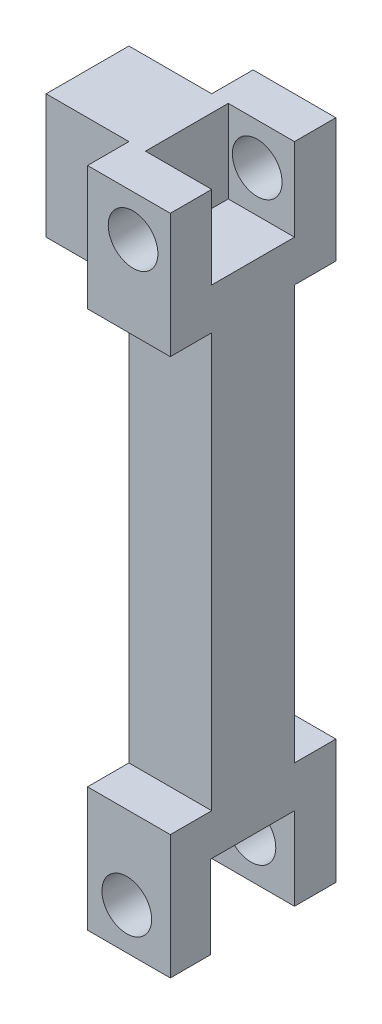
ISO-10303-21;
HEADER;
FILE_DESCRIPTION(('STEP AP214'),'2;1');
FILE_NAME('part.step','',(''),(''),'','','');
FILE_SCHEMA(('AUTOMOTIVE_DESIGN { 1 0 10303 214 1 1 1 1 }'));
ENDSEC;
DATA;
#1=APPLICATION_CONTEXT('core data for automotive mechanical design processes');
#2=APPLICATION_PROTOCOL_DEFINITION('international standard','automotive_design',2000,#1);
#3=PRODUCT_CONTEXT('',#1,'mechanical');
#4=PRODUCT('Part','Part','',(#3));
#5=PRODUCT_RELATED_PRODUCT_CATEGORY('part','',(#4));
#6=PRODUCT_DEFINITION_FORMATION('','',#4);
#7=PRODUCT_DEFINITION_CONTEXT('part definition',#1,'design');
#8=PRODUCT_DEFINITION('design','',#6,#7);
#9=PRODUCT_DEFINITION_SHAPE('','',#8);
#10=(LENGTH_UNIT() NAMED_UNIT(*) SI_UNIT(.MILLI.,.METRE.));
#11=(NAMED_UNIT(*) PLANE_ANGLE_UNIT() SI_UNIT($,.RADIAN.));
#12=(NAMED_UNIT(*) SI_UNIT($,.STERADIAN.) SOLID_ANGLE_UNIT());
#13=UNCERTAINTY_MEASURE_WITH_UNIT(LENGTH_MEASURE(1.E-05),#10,'distance_accuracy_value','');
#14=(GEOMETRIC_REPRESENTATION_CONTEXT(3) GLOBAL_UNCERTAINTY_ASSIGNED_CONTEXT((#13)) GLOBAL_UNIT_ASSIGNED_CONTEXT((#10,
#11,#12)) REPRESENTATION_CONTEXT('',''));
#15=CARTESIAN_POINT('',(0.,0.,0.));
#16=DIRECTION('',(0.,0.,1.));
#17=DIRECTION('',(1.,0.,0.));
#18=AXIS2_PLACEMENT_3D('',#15,#16,#17);
#19=CARTESIAN_POINT('',(-29.9761133603239,67.4933873144399,-25.4));
#20=DIRECTION('',(0.,0.,1.));
#21=DIRECTION('',(1.,0.,0.));
#22=AXIS2_PLACEMENT_3D('',#19,#20,#21);
#23=PLANE('',#22);
#24=DIRECTION('',(0.,-1.,0.));
#25=VECTOR('',#24,1.);
#26=CARTESIAN_POINT('',(-29.9761133603239,29.3933873144399,-25.4));
#27=LINE('',#26,#25);
#28=CARTESIAN_POINT('',(-29.9761133603239,29.39338731444,-25.4));
#29=VERTEX_POINT('',#28);
#30=CARTESIAN_POINT('',(-29.9761133603239,-97.6066126855601,-25.4));
#31=VERTEX_POINT('',#30);
#32=EDGE_CURVE('E363',#29,#31,#27,.T.);
#33=ORIENTED_EDGE('',*,*,#32,.F.);
#34=DIRECTION('',(1.,0.,0.));
#35=VECTOR('',#34,1.);
#36=CARTESIAN_POINT('',(-29.9761133603239,29.39338731444,-25.4));
#37=LINE('',#36,#35);
#38=CARTESIAN_POINT('',(-4.5761133603239,29.39338731444,-25.4));
#39=VERTEX_POINT('',#38);
#40=EDGE_CURVE('E246',#29,#39,#37,.T.);
#41=ORIENTED_EDGE('',*,*,#40,.T.);
#42=DIRECTION('',(0.,1.,0.));
#43=VECTOR('',#42,1.);
#44=CARTESIAN_POINT('',(-4.5761133603239,67.4933873144399,-25.4));
#45=LINE('',#44,#43);
#46=CARTESIAN_POINT('',(-4.57611336032388,-97.6066126855601,-25.4));
#47=VERTEX_POINT('',#46);
#48=EDGE_CURVE('E360',#47,#39,#45,.T.);
#49=ORIENTED_EDGE('',*,*,#48,.F.);
#50=DIRECTION('',(-1.,0.,0.));
#51=VECTOR('',#50,1.);
#52=CARTESIAN_POINT('',(-4.57611336032388,-97.6066126855601,-25.4));
#53=LINE('',#52,#51);
#54=EDGE_CURVE('E394',#47,#31,#53,.T.);
#55=ORIENTED_EDGE('',*,*,#54,.T.);
#56=EDGE_LOOP('',(#33,#41,#49,#55));
#57=FACE_BOUND('',#56,.T.);
#58=ADVANCED_FACE('F35',(#57),#23,.F.);
#59=CARTESIAN_POINT('',(-29.9761133603239,67.4933873144399,0.));
#60=DIRECTION('',(0.,0.,1.));
#61=DIRECTION('',(1.,0.,0.));
#62=AXIS2_PLACEMENT_3D('',#59,#60,#61);
#63=PLANE('',#62);
#64=DIRECTION('',(1.,0.,0.));
#65=VECTOR('',#64,1.);
#66=CARTESIAN_POINT('',(-29.9761133603239,29.3933873144399,0.));
#67=LINE('',#66,#65);
#68=CARTESIAN_POINT('',(-55.3761133603239,29.3933873144399,0.));
#69=VERTEX_POINT('',#68);
#70=CARTESIAN_POINT('',(-29.9761133603239,29.3933873144399,0.));
#71=VERTEX_POINT('',#70);
#72=EDGE_CURVE('E383',#69,#71,#67,.T.);
#73=ORIENTED_EDGE('',*,*,#72,.T.);
#74=DIRECTION('',(0.,1.,0.));
#75=VECTOR('',#74,1.);
#76=CARTESIAN_POINT('',(-29.9761133603239,67.49338731444,0.));
#77=LINE('',#76,#75);
#78=CARTESIAN_POINT('',(-29.9761133603239,67.4933873144399,0.));
#79=VERTEX_POINT('',#78);
#80=EDGE_CURVE('E58',#71,#79,#77,.T.);
#81=ORIENTED_EDGE('',*,*,#80,.T.);
#82=DIRECTION('',(-1.,0.,0.));
#83=VECTOR('',#82,1.);
#84=CARTESIAN_POINT('',(-29.9761133603239,67.4933873144399,0.));
#85=LINE('',#84,#83);
#86=CARTESIAN_POINT('',(-55.3761133603239,67.4933873144399,0.));
#87=VERTEX_POINT('',#86);
#88=EDGE_CURVE('E378',#79,#87,#85,.T.);
#89=ORIENTED_EDGE('',*,*,#88,.T.);
#90=DIRECTION('',(0.,-1.,0.));
#91=VECTOR('',#90,1.);
#92=CARTESIAN_POINT('',(-55.3761133603239,67.4933873144399,0.));
#93=LINE('',#92,#91);
#94=EDGE_CURVE('E403',#87,#69,#93,.T.);
#95=ORIENTED_EDGE('',*,*,#94,.T.);
#96=EDGE_LOOP('',(#73,#81,#89,#95));
#97=FACE_BOUND('',#96,.T.);
#98=ADVANCED_FACE('F492',(#97),#63,.T.);
#99=CARTESIAN_POINT('',(-4.57611336032388,-135.70661268556,-25.4));
#100=DIRECTION('',(0.,-1.,0.));
#101=DIRECTION('',(0.,0.,-1.));
#102=AXIS2_PLACEMENT_3D('',#99,#100,#101);
#103=PLANE('',#102);
#104=DIRECTION('',(-1.,0.,0.));
#105=VECTOR('',#104,1.);
#106=CARTESIAN_POINT('',(-4.57611336032387,-135.70661268556,0.351736714748092));
#107=LINE('',#106,#105);
#108=CARTESIAN_POINT('',(-4.57611336032387,-135.70661268556,0.351736714748092));
#109=VERTEX_POINT('',#108);
#110=CARTESIAN_POINT('',(-29.9761133603239,-135.70661268556,0.351736714748092));
#111=VERTEX_POINT('',#110);
#112=EDGE_CURVE('E297',#109,#111,#107,.T.);
#113=ORIENTED_EDGE('',*,*,#112,.F.);
#114=DIRECTION('',(0.,0.,1.));
#115=VECTOR('',#114,1.);
#116=CARTESIAN_POINT('',(-4.57611336032388,-135.70661268556,-25.4));
#117=LINE('',#116,#115);
#118=CARTESIAN_POINT('',(-4.57611336032387,-135.70661268556,12.7));
#119=VERTEX_POINT('',#118);
#120=EDGE_CURVE('E347',#109,#119,#117,.T.);
#121=ORIENTED_EDGE('',*,*,#120,.T.);
#122=DIRECTION('',(-1.,0.,0.));
#123=VECTOR('',#122,1.);
#124=CARTESIAN_POINT('',(-4.57611336032387,-135.70661268556,12.7));
#125=LINE('',#124,#123);
#126=CARTESIAN_POINT('',(-29.9761133603239,-135.70661268556,12.7));
#127=VERTEX_POINT('',#126);
#128=EDGE_CURVE('E315',#119,#127,#125,.T.);
#129=ORIENTED_EDGE('',*,*,#128,.T.);
#130=DIRECTION('',(0.,0.,1.));
#131=VECTOR('',#130,1.);
#132=CARTESIAN_POINT('',(-29.9761133603239,-135.70661268556,-25.4));
#133=LINE('',#132,#131);
#134=EDGE_CURVE('E351',#111,#127,#133,.T.);
#135=ORIENTED_EDGE('',*,*,#134,.F.);
#136=EDGE_LOOP('',(#113,#121,#129,#135));
#137=FACE_BOUND('',#136,.T.);
#138=ADVANCED_FACE('F438',(#137),#103,.T.);
#139=CARTESIAN_POINT('',(-29.9761133603239,67.4933873144399,-25.4));
#140=DIRECTION('',(0.,1.,0.));
#141=DIRECTION('',(0.,0.,1.));
#142=AXIS2_PLACEMENT_3D('',#139,#140,#141);
#143=PLANE('',#142);
#144=DIRECTION('',(1.,0.,0.));
#145=VECTOR('',#144,1.);
#146=CARTESIAN_POINT('',(-24.8961133603239,67.49338731444,0.));
#147=LINE('',#146,#145);
#148=CARTESIAN_POINT('',(-24.8961133603239,67.49338731444,0.));
#149=VERTEX_POINT('',#148);
#150=CARTESIAN_POINT('',(-4.5761133603239,67.49338731444,0.));
#151=VERTEX_POINT('',#150);
#152=EDGE_CURVE('E225',#149,#151,#147,.T.);
#153=ORIENTED_EDGE('',*,*,#152,.F.);
#154=DIRECTION('',(0.,0.,1.));
#155=VECTOR('',#154,1.);
#156=CARTESIAN_POINT('',(-24.8961133603239,67.49338731444,0.));
#157=LINE('',#156,#155);
#158=CARTESIAN_POINT('',(-24.8961133603239,67.49338731444,-25.4));
#159=VERTEX_POINT('',#158);
#160=EDGE_CURVE('E222',#159,#149,#157,.T.);
#161=ORIENTED_EDGE('',*,*,#160,.F.);
#162=DIRECTION('',(1.,0.,0.));
#163=VECTOR('',#162,1.);
#164=CARTESIAN_POINT('',(-24.8961133603239,67.49338731444,-25.4));
#165=LINE('',#164,#163);
#166=CARTESIAN_POINT('',(-4.5761133603239,67.49338731444,-25.4));
#167=VERTEX_POINT('',#166);
#168=EDGE_CURVE('E201',#159,#167,#165,.T.);
#169=ORIENTED_EDGE('',*,*,#168,.T.);
#170=DIRECTION('',(0.,0.,1.));
#171=VECTOR('',#170,1.);
#172=CARTESIAN_POINT('',(-4.5761133603239,67.4933873144399,-25.4));
#173=LINE('',#172,#171);
#174=CARTESIAN_POINT('',(-4.5761133603239,67.4933873144399,-38.1));
#175=VERTEX_POINT('',#174);
#176=EDGE_CURVE('E212',#175,#167,#173,.T.);
#177=ORIENTED_EDGE('',*,*,#176,.F.);
#178=DIRECTION('',(1.,0.,0.));
#179=VECTOR('',#178,1.);
#180=CARTESIAN_POINT('',(-29.9761133603239,67.4933873144399,-38.1));
#181=LINE('',#180,#179);
#182=CARTESIAN_POINT('',(-29.9761133603239,67.4933873144399,-38.1));
#183=VERTEX_POINT('',#182);
#184=EDGE_CURVE('E250',#183,#175,#181,.T.);
#185=ORIENTED_EDGE('',*,*,#184,.F.);
#186=DIRECTION('',(0.,0.,1.));
#187=VECTOR('',#186,1.);
#188=CARTESIAN_POINT('',(-29.9761133603239,67.4933873144399,-25.4));
#189=LINE('',#188,#187);
#190=CARTESIAN_POINT('',(-29.9761133603239,67.4933873144399,-25.4));
#191=VERTEX_POINT('',#190);
#192=EDGE_CURVE('E240',#183,#191,#189,.T.);
#193=ORIENTED_EDGE('',*,*,#192,.T.);
#194=DIRECTION('',(-1.,0.,0.));
#195=VECTOR('',#194,1.);
#196=CARTESIAN_POINT('',(-29.9761133603239,67.4933873144399,-25.4));
#197=LINE('',#196,#195);
#198=CARTESIAN_POINT('',(-55.3761133603239,67.4933873144399,-25.4));
#199=VERTEX_POINT('',#198);
#200=EDGE_CURVE('E376',#191,#199,#197,.T.);
#201=ORIENTED_EDGE('',*,*,#200,.T.);
#202=DIRECTION('',(0.,0.,1.));
#203=VECTOR('',#202,1.);
#204=CARTESIAN_POINT('',(-55.3761133603239,67.4933873144399,-25.4));
#205=LINE('',#204,#203);
#206=EDGE_CURVE('E357',#199,#87,#205,.T.);
#207=ORIENTED_EDGE('',*,*,#206,.T.);
#208=ORIENTED_EDGE('',*,*,#88,.F.);
#209=DIRECTION('',(0.,0.,1.));
#210=VECTOR('',#209,1.);
#211=CARTESIAN_POINT('',(-29.9761133603239,67.4933873144399,12.7));
#212=LINE('',#211,#210);
#213=CARTESIAN_POINT('',(-29.9761133603239,67.4933873144399,12.7));
#214=VERTEX_POINT('',#213);
#215=EDGE_CURVE('E266',#79,#214,#212,.T.);
#216=ORIENTED_EDGE('',*,*,#215,.T.);
#217=DIRECTION('',(1.,0.,0.));
#218=VECTOR('',#217,1.);
#219=CARTESIAN_POINT('',(-29.9761133603239,67.4933873144399,12.7));
#220=LINE('',#219,#218);
#221=CARTESIAN_POINT('',(-4.5761133603239,67.4933873144399,12.7));
#222=VERTEX_POINT('',#221);
#223=EDGE_CURVE('E270',#214,#222,#220,.T.);
#224=ORIENTED_EDGE('',*,*,#223,.T.);
#225=EDGE_CURVE('E338',#151,#222,#173,.T.);
#226=ORIENTED_EDGE('',*,*,#225,.F.);
#227=EDGE_LOOP('',(#153,#161,#169,#177,#185,#193,#201,#207,#208,#216,#224,#226));
#228=FACE_BOUND('',#227,.T.);
#229=ADVANCED_FACE('F473',(#228),#143,.T.);
#230=CARTESIAN_POINT('',(-4.5761133603239,67.4933873144399,-25.4));
#231=DIRECTION('',(1.,0.,0.));
#232=DIRECTION('',(0.,1.,0.));
#233=AXIS2_PLACEMENT_3D('',#230,#231,#232);
#234=PLANE('',#233);
#235=DIRECTION('',(0.,-1.,0.));
#236=VECTOR('',#235,1.);
#237=CARTESIAN_POINT('',(-4.5761133603239,67.49338731444,0.));
#238=LINE('',#237,#236);
#239=CARTESIAN_POINT('',(-4.5761133603239,42.09338731444,0.));
#240=VERTEX_POINT('',#239);
#241=EDGE_CURVE('E50',#151,#240,#238,.T.);
#242=ORIENTED_EDGE('',*,*,#241,.F.);
#243=ORIENTED_EDGE('',*,*,#225,.T.);
#244=DIRECTION('',(0.,-1.,0.));
#245=VECTOR('',#244,1.);
#246=CARTESIAN_POINT('',(-4.5761133603239,67.4933873144399,12.7));
#247=LINE('',#246,#245);
#248=CARTESIAN_POINT('',(-4.5761133603239,29.3933873144399,12.7));
#249=VERTEX_POINT('',#248);
#250=EDGE_CURVE('E249',#222,#249,#247,.T.);
#251=ORIENTED_EDGE('',*,*,#250,.T.);
#252=DIRECTION('',(0.,0.,-1.));
#253=VECTOR('',#252,1.);
#254=CARTESIAN_POINT('',(-4.5761133603239,29.3933873144399,12.7));
#255=LINE('',#254,#253);
#256=CARTESIAN_POINT('',(-4.5761133603239,29.3933873144399,0.));
#257=VERTEX_POINT('',#256);
#258=EDGE_CURVE('E256',#249,#257,#255,.T.);
#259=ORIENTED_EDGE('',*,*,#258,.T.);
#260=DIRECTION('',(0.,1.,0.));
#261=VECTOR('',#260,1.);
#262=CARTESIAN_POINT('',(-4.5761133603239,67.4933873144399,0.));
#263=LINE('',#262,#261);
#264=CARTESIAN_POINT('',(-4.57611336032388,-97.6066126855601,0.));
#265=VERTEX_POINT('',#264);
#266=EDGE_CURVE('E325',#265,#257,#263,.T.);
#267=ORIENTED_EDGE('',*,*,#266,.F.);
#268=DIRECTION('',(0.,0.,-1.));
#269=VECTOR('',#268,1.);
#270=CARTESIAN_POINT('',(-4.57611336032388,-97.6066126855601,0.));
#271=LINE('',#270,#269);
#272=CARTESIAN_POINT('',(-4.57611336032388,-97.6066126855601,12.7));
#273=VERTEX_POINT('',#272);
#274=EDGE_CURVE('E307',#273,#265,#271,.T.);
#275=ORIENTED_EDGE('',*,*,#274,.F.);
#276=DIRECTION('',(0.,1.,0.));
#277=VECTOR('',#276,1.);
#278=CARTESIAN_POINT('',(-4.57611336032387,-135.70661268556,12.7));
#279=LINE('',#278,#277);
#280=EDGE_CURVE('E308',#119,#273,#279,.T.);
#281=ORIENTED_EDGE('',*,*,#280,.F.);
#282=ORIENTED_EDGE('',*,*,#120,.F.);
#283=DIRECTION('',(0.,1.,0.));
#284=VECTOR('',#283,1.);
#285=CARTESIAN_POINT('',(-4.57611336032387,-135.70661268556,0.351736714748092));
#286=LINE('',#285,#284);
#287=CARTESIAN_POINT('',(-4.57611336032388,-110.30661268556,0.351736714748092));
#288=VERTEX_POINT('',#287);
#289=EDGE_CURVE('E290',#109,#288,#286,.T.);
#290=ORIENTED_EDGE('',*,*,#289,.T.);
#291=DIRECTION('',(0.,0.,-1.));
#292=VECTOR('',#291,1.);
#293=CARTESIAN_POINT('',(-4.57611336032388,-110.30661268556,0.351736714748092));
#294=LINE('',#293,#292);
#295=CARTESIAN_POINT('',(-4.57611336032388,-110.30661268556,-25.4));
#296=VERTEX_POINT('',#295);
#297=EDGE_CURVE('E284',#288,#296,#294,.T.);
#298=ORIENTED_EDGE('',*,*,#297,.T.);
#299=DIRECTION('',(0.,-1.,0.));
#300=VECTOR('',#299,1.);
#301=CARTESIAN_POINT('',(-4.57611336032388,-110.30661268556,-25.4));
#302=LINE('',#301,#300);
#303=CARTESIAN_POINT('',(-4.57611336032387,-135.70661268556,-25.4));
#304=VERTEX_POINT('',#303);
#305=EDGE_CURVE('E287',#296,#304,#302,.T.);
#306=ORIENTED_EDGE('',*,*,#305,.T.);
#307=CARTESIAN_POINT('',(-4.57611336032387,-135.70661268556,-38.1));
#308=VERTEX_POINT('',#307);
#309=EDGE_CURVE('E340',#308,#304,#117,.T.);
#310=ORIENTED_EDGE('',*,*,#309,.F.);
#311=DIRECTION('',(0.,-1.,0.));
#312=VECTOR('',#311,1.);
#313=CARTESIAN_POINT('',(-4.57611336032387,-135.70661268556,-38.1));
#314=LINE('',#313,#312);
#315=CARTESIAN_POINT('',(-4.57611336032388,-97.6066126855601,-38.1));
#316=VERTEX_POINT('',#315);
#317=EDGE_CURVE('E393',#316,#308,#314,.T.);
#318=ORIENTED_EDGE('',*,*,#317,.F.);
#319=DIRECTION('',(0.,0.,-1.));
#320=VECTOR('',#319,1.);
#321=CARTESIAN_POINT('',(-4.57611336032388,-97.6066126855601,-38.1));
#322=LINE('',#321,#320);
#323=EDGE_CURVE('E389',#47,#316,#322,.T.);
#324=ORIENTED_EDGE('',*,*,#323,.F.);
#325=ORIENTED_EDGE('',*,*,#48,.T.);
#326=DIRECTION('',(0.,0.,-1.));
#327=VECTOR('',#326,1.);
#328=CARTESIAN_POINT('',(-4.5761133603239,29.39338731444,-25.4));
#329=LINE('',#328,#327);
#330=CARTESIAN_POINT('',(-4.5761133603239,29.3933873144399,-38.1));
#331=VERTEX_POINT('',#330);
#332=EDGE_CURVE('E227',#39,#331,#329,.T.);
#333=ORIENTED_EDGE('',*,*,#332,.T.);
#334=DIRECTION('',(0.,1.,0.));
#335=VECTOR('',#334,1.);
#336=CARTESIAN_POINT('',(-4.5761133603239,67.4933873144399,-38.1));
#337=LINE('',#336,#335);
#338=EDGE_CURVE('E232',#331,#175,#337,.T.);
#339=ORIENTED_EDGE('',*,*,#338,.T.);
#340=ORIENTED_EDGE('',*,*,#176,.T.);
#341=DIRECTION('',(0.,1.,0.));
#342=VECTOR('',#341,1.);
#343=CARTESIAN_POINT('',(-4.5761133603239,67.49338731444,-25.4));
#344=LINE('',#343,#342);
#345=CARTESIAN_POINT('',(-4.5761133603239,42.09338731444,-25.4));
#346=VERTEX_POINT('',#345);
#347=EDGE_CURVE('E194',#346,#167,#344,.T.);
#348=ORIENTED_EDGE('',*,*,#347,.F.);
#349=DIRECTION('',(0.,0.,-1.));
#350=VECTOR('',#349,1.);
#351=CARTESIAN_POINT('',(-4.5761133603239,42.09338731444,0.));
#352=LINE('',#351,#350);
#353=EDGE_CURVE('E205',#240,#346,#352,.T.);
#354=ORIENTED_EDGE('',*,*,#353,.F.);
#355=EDGE_LOOP('',(#242,#243,#251,#259,#267,#275,#281,#282,#290,#298,#306,#310,#318,#324,#325,
#333,#339,#340,#348,#354));
#356=FACE_BOUND('',#355,.T.);
#357=ADVANCED_FACE('F210',(#356),#234,.T.);
#358=DIRECTION('',(-1.,0.,0.));
#359=VECTOR('',#358,1.);
#360=CARTESIAN_POINT('',(-4.57611336032387,-135.70661268556,-25.4));
#361=LINE('',#360,#359);
#362=CARTESIAN_POINT('',(-29.9761133603239,-135.70661268556,-25.4));
#363=VERTEX_POINT('',#362);
#364=EDGE_CURVE('E299',#304,#363,#361,.T.);
#365=ORIENTED_EDGE('',*,*,#364,.T.);
#366=CARTESIAN_POINT('',(-29.9761133603239,-135.70661268556,-38.1));
#367=VERTEX_POINT('',#366);
#368=EDGE_CURVE('E348',#367,#363,#133,.T.);
#369=ORIENTED_EDGE('',*,*,#368,.F.);
#370=DIRECTION('',(-1.,0.,0.));
#371=VECTOR('',#370,1.);
#372=CARTESIAN_POINT('',(-4.57611336032387,-135.70661268556,-38.1));
#373=LINE('',#372,#371);
#374=EDGE_CURVE('E392',#308,#367,#373,.T.);
#375=ORIENTED_EDGE('',*,*,#374,.F.);
#376=ORIENTED_EDGE('',*,*,#309,.T.);
#377=EDGE_LOOP('',(#365,#369,#375,#376));
#378=FACE_BOUND('',#377,.T.);
#379=ADVANCED_FACE('F425',(#378),#103,.T.);
#380=CARTESIAN_POINT('',(-29.9761133603239,29.3933873144399,-25.4));
#381=DIRECTION('',(-1.,0.,0.));
#382=DIRECTION('',(0.,-1.,0.));
#383=AXIS2_PLACEMENT_3D('',#380,#381,#382);
#384=PLANE('',#383);
#385=DIRECTION('',(0.,1.,0.));
#386=VECTOR('',#385,1.);
#387=CARTESIAN_POINT('',(-29.9761133603239,-135.70661268556,0.351736714748092));
#388=LINE('',#387,#386);
#389=CARTESIAN_POINT('',(-29.9761133603239,-110.30661268556,0.351736714748092));
#390=VERTEX_POINT('',#389);
#391=EDGE_CURVE('E281',#111,#390,#388,.T.);
#392=ORIENTED_EDGE('',*,*,#391,.F.);
#393=ORIENTED_EDGE('',*,*,#134,.T.);
#394=DIRECTION('',(0.,1.,0.));
#395=VECTOR('',#394,1.);
#396=CARTESIAN_POINT('',(-29.9761133603239,-135.70661268556,12.7));
#397=LINE('',#396,#395);
#398=CARTESIAN_POINT('',(-29.9761133603239,-97.6066126855601,12.7));
#399=VERTEX_POINT('',#398);
#400=EDGE_CURVE('E304',#127,#399,#397,.T.);
#401=ORIENTED_EDGE('',*,*,#400,.T.);
#402=DIRECTION('',(0.,0.,-1.));
#403=VECTOR('',#402,1.);
#404=CARTESIAN_POINT('',(-29.9761133603239,-97.6066126855601,0.));
#405=LINE('',#404,#403);
#406=CARTESIAN_POINT('',(-29.9761133603239,-97.6066126855601,0.));
#407=VERTEX_POINT('',#406);
#408=EDGE_CURVE('E296',#399,#407,#405,.T.);
#409=ORIENTED_EDGE('',*,*,#408,.T.);
#410=DIRECTION('',(0.,-1.,0.));
#411=VECTOR('',#410,1.);
#412=CARTESIAN_POINT('',(-29.9761133603239,29.3933873144399,0.));
#413=LINE('',#412,#411);
#414=EDGE_CURVE('E385',#71,#407,#413,.T.);
#415=ORIENTED_EDGE('',*,*,#414,.F.);
#416=DIRECTION('',(0.,0.,1.));
#417=VECTOR('',#416,1.);
#418=CARTESIAN_POINT('',(-29.9761133603239,29.3933873144399,-25.4));
#419=LINE('',#418,#417);
#420=EDGE_CURVE('E352',#29,#71,#419,.T.);
#421=ORIENTED_EDGE('',*,*,#420,.F.);
#422=ORIENTED_EDGE('',*,*,#32,.T.);
#423=DIRECTION('',(0.,0.,-1.));
#424=VECTOR('',#423,1.);
#425=CARTESIAN_POINT('',(-29.9761133603239,-97.6066126855601,-38.1));
#426=LINE('',#425,#424);
#427=CARTESIAN_POINT('',(-29.9761133603239,-97.6066126855601,-38.1));
#428=VERTEX_POINT('',#427);
#429=EDGE_CURVE('E367',#31,#428,#426,.T.);
#430=ORIENTED_EDGE('',*,*,#429,.T.);
#431=DIRECTION('',(0.,-1.,0.));
#432=VECTOR('',#431,1.);
#433=CARTESIAN_POINT('',(-29.9761133603239,-135.70661268556,-38.1));
#434=LINE('',#433,#432);
#435=EDGE_CURVE('E314',#428,#367,#434,.T.);
#436=ORIENTED_EDGE('',*,*,#435,.T.);
#437=ORIENTED_EDGE('',*,*,#368,.T.);
#438=DIRECTION('',(0.,-1.,0.));
#439=VECTOR('',#438,1.);
#440=CARTESIAN_POINT('',(-29.9761133603239,-110.30661268556,-25.4));
#441=LINE('',#440,#439);
#442=CARTESIAN_POINT('',(-29.9761133603239,-110.30661268556,-25.4));
#443=VERTEX_POINT('',#442);
#444=EDGE_CURVE('E279',#443,#363,#441,.T.);
#445=ORIENTED_EDGE('',*,*,#444,.F.);
#446=DIRECTION('',(0.,0.,-1.));
#447=VECTOR('',#446,1.);
#448=CARTESIAN_POINT('',(-29.9761133603239,-110.30661268556,0.351736714748092));
#449=LINE('',#448,#447);
#450=EDGE_CURVE('E273',#390,#443,#449,.T.);
#451=ORIENTED_EDGE('',*,*,#450,.F.);
#452=EDGE_LOOP('',(#392,#393,#401,#409,#415,#421,#422,#430,#436,#437,#445,#451));
#453=FACE_BOUND('',#452,.T.);
#454=ADVANCED_FACE('F419',(#453),#384,.T.);
#455=CARTESIAN_POINT('',(-29.9761133603239,29.3933873144399,-25.4));
#456=DIRECTION('',(0.,-1.,0.));
#457=DIRECTION('',(1.,0.,0.));
#458=AXIS2_PLACEMENT_3D('',#455,#456,#457);
#459=PLANE('',#458);
#460=ORIENTED_EDGE('',*,*,#72,.F.);
#461=DIRECTION('',(0.,0.,1.));
#462=VECTOR('',#461,1.);
#463=CARTESIAN_POINT('',(-55.3761133603239,29.3933873144399,-25.4));
#464=LINE('',#463,#462);
#465=CARTESIAN_POINT('',(-55.3761133603239,29.3933873144399,-25.4));
#466=VERTEX_POINT('',#465);
#467=EDGE_CURVE('E355',#466,#69,#464,.T.);
#468=ORIENTED_EDGE('',*,*,#467,.F.);
#469=DIRECTION('',(1.,0.,0.));
#470=VECTOR('',#469,1.);
#471=CARTESIAN_POINT('',(-29.9761133603239,29.3933873144399,-25.4));
#472=LINE('',#471,#470);
#473=EDGE_CURVE('E366',#466,#29,#472,.T.);
#474=ORIENTED_EDGE('',*,*,#473,.T.);
#475=ORIENTED_EDGE('',*,*,#420,.T.);
#476=EDGE_LOOP('',(#460,#468,#474,#475));
#477=FACE_BOUND('',#476,.T.);
#478=ADVANCED_FACE('F460',(#477),#459,.T.);
#479=CARTESIAN_POINT('',(-55.3761133603239,67.4933873144399,-25.4));
#480=DIRECTION('',(-1.,0.,0.));
#481=DIRECTION('',(0.,-1.,0.));
#482=AXIS2_PLACEMENT_3D('',#479,#480,#481);
#483=PLANE('',#482);
#484=CARTESIAN_POINT('',(-55.3761133603239,49.4297522150103,-13.0885412320957));
#485=DIRECTION('',(-1.,0.,0.));
#486=DIRECTION('',(0.,-1.,0.));
#487=AXIS2_PLACEMENT_3D('',#484,#485,#486);
#488=CIRCLE('',#487,7.62);
#489=CARTESIAN_POINT('',(-55.3761133603239,41.8097522150103,-13.0885412320957));
#490=VERTEX_POINT('',#489);
#491=EDGE_CURVE('E687',#490,#490,#488,.T.);
#492=ORIENTED_EDGE('',*,*,#491,.F.);
#493=EDGE_LOOP('',(#492));
#494=FACE_BOUND('',#493,.T.);
#495=ORIENTED_EDGE('',*,*,#94,.F.);
#496=ORIENTED_EDGE('',*,*,#206,.F.);
#497=DIRECTION('',(0.,-1.,0.));
#498=VECTOR('',#497,1.);
#499=CARTESIAN_POINT('',(-55.3761133603239,67.4933873144399,-25.4));
#500=LINE('',#499,#498);
#501=EDGE_CURVE('E373',#199,#466,#500,.T.);
#502=ORIENTED_EDGE('',*,*,#501,.T.);
#503=ORIENTED_EDGE('',*,*,#467,.T.);
#504=EDGE_LOOP('',(#495,#496,#502,#503));
#505=FACE_BOUND('',#504,.T.);
#506=ADVANCED_FACE('F37',(#494,#505),#483,.T.);
#507=ORIENTED_EDGE('',*,*,#200,.F.);
#508=DIRECTION('',(0.,-1.,0.));
#509=VECTOR('',#508,1.);
#510=CARTESIAN_POINT('',(-29.9761133603239,67.4933873144399,-25.4));
#511=LINE('',#510,#509);
#512=EDGE_CURVE('E242',#191,#29,#511,.T.);
#513=ORIENTED_EDGE('',*,*,#512,.T.);
#514=ORIENTED_EDGE('',*,*,#473,.F.);
#515=ORIENTED_EDGE('',*,*,#501,.F.);
#516=EDGE_LOOP('',(#507,#513,#514,#515));
#517=FACE_BOUND('',#516,.T.);
#518=ADVANCED_FACE('F480',(#517),#23,.F.);
#519=DIRECTION('',(1.,0.,0.));
#520=VECTOR('',#519,1.);
#521=CARTESIAN_POINT('',(-29.9761133603239,29.39338731444,0.));
#522=LINE('',#521,#520);
#523=EDGE_CURVE('E274',#71,#257,#522,.T.);
#524=ORIENTED_EDGE('',*,*,#523,.F.);
#525=ORIENTED_EDGE('',*,*,#414,.T.);
#526=DIRECTION('',(-1.,0.,0.));
#527=VECTOR('',#526,1.);
#528=CARTESIAN_POINT('',(-4.57611336032388,-97.6066126855601,0.));
#529=LINE('',#528,#527);
#530=EDGE_CURVE('E311',#265,#407,#529,.T.);
#531=ORIENTED_EDGE('',*,*,#530,.F.);
#532=ORIENTED_EDGE('',*,*,#266,.T.);
#533=EDGE_LOOP('',(#524,#525,#531,#532));
#534=FACE_BOUND('',#533,.T.);
#535=ADVANCED_FACE('F452',(#534),#63,.T.);
#536=CARTESIAN_POINT('',(-4.57611336032387,-135.70661268556,-38.1));
#537=DIRECTION('',(0.,0.,-1.));
#538=DIRECTION('',(-1.,0.,0.));
#539=AXIS2_PLACEMENT_3D('',#536,#537,#538);
#540=PLANE('',#539);
#541=CARTESIAN_POINT('',(-17.931310165358,-123.00661268556,-38.1000000000001));
#542=DIRECTION('',(0.,0.,-1.));
#543=DIRECTION('',(0.,1.,0.));
#544=AXIS2_PLACEMENT_3D('',#541,#542,#543);
#545=CIRCLE('',#544,7.62);
#546=CARTESIAN_POINT('',(-17.931310165358,-115.38661268556,-38.1000000000001));
#547=VERTEX_POINT('',#546);
#548=EDGE_CURVE('E669',#547,#547,#545,.T.);
#549=ORIENTED_EDGE('',*,*,#548,.F.);
#550=EDGE_LOOP('',(#549));
#551=FACE_BOUND('',#550,.T.);
#552=ORIENTED_EDGE('',*,*,#435,.F.);
#553=DIRECTION('',(-1.,0.,0.));
#554=VECTOR('',#553,1.);
#555=CARTESIAN_POINT('',(-4.57611336032388,-97.6066126855601,-38.1));
#556=LINE('',#555,#554);
#557=EDGE_CURVE('E397',#316,#428,#556,.T.);
#558=ORIENTED_EDGE('',*,*,#557,.F.);
#559=ORIENTED_EDGE('',*,*,#317,.T.);
#560=ORIENTED_EDGE('',*,*,#374,.T.);
#561=EDGE_LOOP('',(#552,#558,#559,#560));
#562=FACE_BOUND('',#561,.T.);
#563=ADVANCED_FACE('F415',(#551,#562),#540,.T.);
#564=CARTESIAN_POINT('',(-4.57611336032388,-97.6066126855601,-38.1));
#565=DIRECTION('',(0.,1.,0.));
#566=DIRECTION('',(-1.,0.,0.));
#567=AXIS2_PLACEMENT_3D('',#564,#565,#566);
#568=PLANE('',#567);
#569=ORIENTED_EDGE('',*,*,#429,.F.);
#570=ORIENTED_EDGE('',*,*,#54,.F.);
#571=ORIENTED_EDGE('',*,*,#323,.T.);
#572=ORIENTED_EDGE('',*,*,#557,.T.);
#573=EDGE_LOOP('',(#569,#570,#571,#572));
#574=FACE_BOUND('',#573,.T.);
#575=ADVANCED_FACE('F408',(#574),#568,.T.);
#576=CARTESIAN_POINT('',(-4.57611336032388,-97.6066126855601,0.));
#577=DIRECTION('',(0.,1.,0.));
#578=DIRECTION('',(-1.,0.,0.));
#579=AXIS2_PLACEMENT_3D('',#576,#577,#578);
#580=PLANE('',#579);
#581=ORIENTED_EDGE('',*,*,#408,.F.);
#582=DIRECTION('',(-1.,0.,0.));
#583=VECTOR('',#582,1.);
#584=CARTESIAN_POINT('',(-4.57611336032388,-97.6066126855601,12.7));
#585=LINE('',#584,#583);
#586=EDGE_CURVE('E312',#273,#399,#585,.T.);
#587=ORIENTED_EDGE('',*,*,#586,.F.);
#588=ORIENTED_EDGE('',*,*,#274,.T.);
#589=ORIENTED_EDGE('',*,*,#530,.T.);
#590=EDGE_LOOP('',(#581,#587,#588,#589));
#591=FACE_BOUND('',#590,.T.);
#592=ADVANCED_FACE('F448',(#591),#580,.T.);
#593=CARTESIAN_POINT('',(-4.57611336032387,-135.70661268556,12.7));
#594=DIRECTION('',(0.,0.,1.));
#595=DIRECTION('',(1.,0.,0.));
#596=AXIS2_PLACEMENT_3D('',#593,#594,#595);
#597=PLANE('',#596);
#598=CARTESIAN_POINT('',(-17.931310165358,-123.00661268556,12.6999999999999));
#599=DIRECTION('',(0.,0.,-1.));
#600=DIRECTION('',(0.,1.,0.));
#601=AXIS2_PLACEMENT_3D('',#598,#599,#600);
#602=CIRCLE('',#601,7.62);
#603=CARTESIAN_POINT('',(-17.931310165358,-115.38661268556,12.6999999999999));
#604=VERTEX_POINT('',#603);
#605=EDGE_CURVE('E670',#604,#604,#602,.T.);
#606=ORIENTED_EDGE('',*,*,#605,.T.);
#607=EDGE_LOOP('',(#606));
#608=FACE_BOUND('',#607,.T.);
#609=ORIENTED_EDGE('',*,*,#400,.F.);
#610=ORIENTED_EDGE('',*,*,#128,.F.);
#611=ORIENTED_EDGE('',*,*,#280,.T.);
#612=ORIENTED_EDGE('',*,*,#586,.T.);
#613=EDGE_LOOP('',(#609,#610,#611,#612));
#614=FACE_BOUND('',#613,.T.);
#615=ADVANCED_FACE('F444',(#608,#614),#597,.T.);
#616=CARTESIAN_POINT('',(-4.57611336032388,-110.30661268556,0.351736714748092));
#617=DIRECTION('',(0.,1.,0.));
#618=DIRECTION('',(-1.,0.,0.));
#619=AXIS2_PLACEMENT_3D('',#616,#617,#618);
#620=PLANE('',#619);
#621=ORIENTED_EDGE('',*,*,#450,.T.);
#622=DIRECTION('',(-1.,0.,0.));
#623=VECTOR('',#622,1.);
#624=CARTESIAN_POINT('',(-4.57611336032388,-110.30661268556,-25.4));
#625=LINE('',#624,#623);
#626=EDGE_CURVE('E293',#296,#443,#625,.T.);
#627=ORIENTED_EDGE('',*,*,#626,.F.);
#628=ORIENTED_EDGE('',*,*,#297,.F.);
#629=DIRECTION('',(-1.,0.,0.));
#630=VECTOR('',#629,1.);
#631=CARTESIAN_POINT('',(-4.57611336032388,-110.30661268556,0.351736714748092));
#632=LINE('',#631,#630);
#633=EDGE_CURVE('E294',#288,#390,#632,.T.);
#634=ORIENTED_EDGE('',*,*,#633,.T.);
#635=EDGE_LOOP('',(#621,#627,#628,#634));
#636=FACE_BOUND('',#635,.T.);
#637=ADVANCED_FACE('F432',(#636),#620,.F.);
#638=CARTESIAN_POINT('',(-4.57611336032387,-135.70661268556,0.351736714748092));
#639=DIRECTION('',(0.,0.,1.));
#640=DIRECTION('',(1.,0.,0.));
#641=AXIS2_PLACEMENT_3D('',#638,#639,#640);
#642=PLANE('',#641);
#643=CARTESIAN_POINT('',(-17.931310165358,-123.00661268556,0.351736714748092));
#644=DIRECTION('',(0.,0.,1.));
#645=DIRECTION('',(1.,0.,0.));
#646=AXIS2_PLACEMENT_3D('',#643,#644,#645);
#647=CIRCLE('',#646,7.62);
#648=CARTESIAN_POINT('',(-10.311310165358,-123.00661268556,0.351736714748092));
#649=VERTEX_POINT('',#648);
#650=EDGE_CURVE('E673',#649,#649,#647,.T.);
#651=ORIENTED_EDGE('',*,*,#650,.T.);
#652=EDGE_LOOP('',(#651));
#653=FACE_BOUND('',#652,.T.);
#654=ORIENTED_EDGE('',*,*,#391,.T.);
#655=ORIENTED_EDGE('',*,*,#633,.F.);
#656=ORIENTED_EDGE('',*,*,#289,.F.);
#657=ORIENTED_EDGE('',*,*,#112,.T.);
#658=EDGE_LOOP('',(#654,#655,#656,#657));
#659=FACE_BOUND('',#658,.T.);
#660=ADVANCED_FACE('F434',(#653,#659),#642,.F.);
#661=CARTESIAN_POINT('',(-4.57611336032388,-110.30661268556,-25.4));
#662=DIRECTION('',(0.,0.,-1.));
#663=DIRECTION('',(0.,1.,0.));
#664=AXIS2_PLACEMENT_3D('',#661,#662,#663);
#665=PLANE('',#664);
#666=CARTESIAN_POINT('',(-17.931310165358,-123.00661268556,-25.4));
#667=DIRECTION('',(0.,0.,-1.));
#668=DIRECTION('',(0.,1.,0.));
#669=AXIS2_PLACEMENT_3D('',#666,#667,#668);
#670=CIRCLE('',#669,7.62);
#671=CARTESIAN_POINT('',(-17.931310165358,-115.38661268556,-25.4));
#672=VERTEX_POINT('',#671);
#673=EDGE_CURVE('E11',#672,#672,#670,.T.);
#674=ORIENTED_EDGE('',*,*,#673,.T.);
#675=EDGE_LOOP('',(#674));
#676=FACE_BOUND('',#675,.T.);
#677=ORIENTED_EDGE('',*,*,#444,.T.);
#678=ORIENTED_EDGE('',*,*,#364,.F.);
#679=ORIENTED_EDGE('',*,*,#305,.F.);
#680=ORIENTED_EDGE('',*,*,#626,.T.);
#681=EDGE_LOOP('',(#677,#678,#679,#680));
#682=FACE_BOUND('',#681,.T.);
#683=ADVANCED_FACE('F429',(#676,#682),#665,.F.);
#684=CARTESIAN_POINT('',(-29.9761133603239,67.4933873144399,12.7));
#685=DIRECTION('',(0.,0.,1.));
#686=DIRECTION('',(0.,-1.,0.));
#687=AXIS2_PLACEMENT_3D('',#684,#685,#686);
#688=PLANE('',#687);
#689=CARTESIAN_POINT('',(-16.0061133603239,54.7933873144399,12.7));
#690=DIRECTION('',(0.,0.,-1.));
#691=DIRECTION('',(0.,1.,0.));
#692=AXIS2_PLACEMENT_3D('',#689,#690,#691);
#693=CIRCLE('',#692,7.61999999999999);
#694=CARTESIAN_POINT('',(-16.0061133603239,62.4133873144399,12.7));
#695=VERTEX_POINT('',#694);
#696=EDGE_CURVE('E681',#695,#695,#693,.T.);
#697=ORIENTED_EDGE('',*,*,#696,.T.);
#698=EDGE_LOOP('',(#697));
#699=FACE_BOUND('',#698,.T.);
#700=ORIENTED_EDGE('',*,*,#250,.F.);
#701=ORIENTED_EDGE('',*,*,#223,.F.);
#702=DIRECTION('',(0.,-1.,0.));
#703=VECTOR('',#702,1.);
#704=CARTESIAN_POINT('',(-29.9761133603239,67.4933873144399,12.7));
#705=LINE('',#704,#703);
#706=CARTESIAN_POINT('',(-29.9761133603239,29.3933873144399,12.7));
#707=VERTEX_POINT('',#706);
#708=EDGE_CURVE('E259',#214,#707,#705,.T.);
#709=ORIENTED_EDGE('',*,*,#708,.T.);
#710=DIRECTION('',(1.,0.,0.));
#711=VECTOR('',#710,1.);
#712=CARTESIAN_POINT('',(-29.9761133603239,29.3933873144399,12.7));
#713=LINE('',#712,#711);
#714=EDGE_CURVE('E269',#707,#249,#713,.T.);
#715=ORIENTED_EDGE('',*,*,#714,.T.);
#716=EDGE_LOOP('',(#700,#701,#709,#715));
#717=FACE_BOUND('',#716,.T.);
#718=ADVANCED_FACE('F644',(#699,#717),#688,.T.);
#719=CARTESIAN_POINT('',(-29.9761133603239,29.3933873144399,12.7));
#720=DIRECTION('',(0.,-1.,0.));
#721=DIRECTION('',(0.,0.,-1.));
#722=AXIS2_PLACEMENT_3D('',#719,#720,#721);
#723=PLANE('',#722);
#724=ORIENTED_EDGE('',*,*,#258,.F.);
#725=ORIENTED_EDGE('',*,*,#714,.F.);
#726=DIRECTION('',(0.,0.,-1.));
#727=VECTOR('',#726,1.);
#728=CARTESIAN_POINT('',(-29.9761133603239,29.3933873144399,12.7));
#729=LINE('',#728,#727);
#730=EDGE_CURVE('E262',#707,#71,#729,.T.);
#731=ORIENTED_EDGE('',*,*,#730,.T.);
#732=ORIENTED_EDGE('',*,*,#523,.T.);
#733=EDGE_LOOP('',(#724,#725,#731,#732));
#734=FACE_BOUND('',#733,.T.);
#735=ADVANCED_FACE('F456',(#734),#723,.T.);
#736=CARTESIAN_POINT('',(-29.9761133603239,29.3933873144399,12.7));
#737=DIRECTION('',(1.,0.,0.));
#738=DIRECTION('',(0.,1.,0.));
#739=AXIS2_PLACEMENT_3D('',#736,#737,#738);
#740=PLANE('',#739);
#741=ORIENTED_EDGE('',*,*,#708,.F.);
#742=ORIENTED_EDGE('',*,*,#215,.F.);
#743=ORIENTED_EDGE('',*,*,#80,.F.);
#744=ORIENTED_EDGE('',*,*,#730,.F.);
#745=EDGE_LOOP('',(#741,#742,#743,#744));
#746=FACE_BOUND('',#745,.T.);
#747=ADVANCED_FACE('F638',(#746),#740,.F.);
#748=CARTESIAN_POINT('',(-29.9761133603239,29.39338731444,-25.4));
#749=DIRECTION('',(0.,-1.,0.));
#750=DIRECTION('',(0.,0.,-1.));
#751=AXIS2_PLACEMENT_3D('',#748,#749,#750);
#752=PLANE('',#751);
#753=ORIENTED_EDGE('',*,*,#332,.F.);
#754=ORIENTED_EDGE('',*,*,#40,.F.);
#755=DIRECTION('',(0.,0.,-1.));
#756=VECTOR('',#755,1.);
#757=CARTESIAN_POINT('',(-29.9761133603239,29.39338731444,-25.4));
#758=LINE('',#757,#756);
#759=CARTESIAN_POINT('',(-29.9761133603239,29.3933873144399,-38.1));
#760=VERTEX_POINT('',#759);
#761=EDGE_CURVE('E234',#29,#760,#758,.T.);
#762=ORIENTED_EDGE('',*,*,#761,.T.);
#763=DIRECTION('',(1.,0.,0.));
#764=VECTOR('',#763,1.);
#765=CARTESIAN_POINT('',(-29.9761133603239,29.3933873144399,-38.1));
#766=LINE('',#765,#764);
#767=EDGE_CURVE('E245',#760,#331,#766,.T.);
#768=ORIENTED_EDGE('',*,*,#767,.T.);
#769=EDGE_LOOP('',(#753,#754,#762,#768));
#770=FACE_BOUND('',#769,.T.);
#771=ADVANCED_FACE('F465',(#770),#752,.T.);
#772=CARTESIAN_POINT('',(-29.9761133603239,67.4933873144399,-38.1));
#773=DIRECTION('',(0.,0.,-1.));
#774=DIRECTION('',(0.,1.,0.));
#775=AXIS2_PLACEMENT_3D('',#772,#773,#774);
#776=PLANE('',#775);
#777=CARTESIAN_POINT('',(-16.0061133603239,54.7933873144399,-38.1));
#778=DIRECTION('',(0.,0.,-1.));
#779=DIRECTION('',(0.,1.,0.));
#780=AXIS2_PLACEMENT_3D('',#777,#778,#779);
#781=CIRCLE('',#780,7.61999999999999);
#782=CARTESIAN_POINT('',(-16.0061133603239,62.4133873144399,-38.1));
#783=VERTEX_POINT('',#782);
#784=EDGE_CURVE('E678',#783,#783,#781,.T.);
#785=ORIENTED_EDGE('',*,*,#784,.F.);
#786=EDGE_LOOP('',(#785));
#787=FACE_BOUND('',#786,.T.);
#788=ORIENTED_EDGE('',*,*,#338,.F.);
#789=ORIENTED_EDGE('',*,*,#767,.F.);
#790=DIRECTION('',(0.,1.,0.));
#791=VECTOR('',#790,1.);
#792=CARTESIAN_POINT('',(-29.9761133603239,67.4933873144399,-38.1));
#793=LINE('',#792,#791);
#794=EDGE_CURVE('E237',#760,#183,#793,.T.);
#795=ORIENTED_EDGE('',*,*,#794,.T.);
#796=ORIENTED_EDGE('',*,*,#184,.T.);
#797=EDGE_LOOP('',(#788,#789,#795,#796));
#798=FACE_BOUND('',#797,.T.);
#799=ADVANCED_FACE('F469',(#787,#798),#776,.T.);
#800=CARTESIAN_POINT('',(-29.9761133603239,29.3933873144399,-25.4));
#801=DIRECTION('',(-1.,0.,0.));
#802=DIRECTION('',(0.,-1.,0.));
#803=AXIS2_PLACEMENT_3D('',#800,#801,#802);
#804=PLANE('',#803);
#805=ORIENTED_EDGE('',*,*,#761,.F.);
#806=ORIENTED_EDGE('',*,*,#512,.F.);
#807=ORIENTED_EDGE('',*,*,#192,.F.);
#808=ORIENTED_EDGE('',*,*,#794,.F.);
#809=EDGE_LOOP('',(#805,#806,#807,#808));
#810=FACE_BOUND('',#809,.T.);
#811=ADVANCED_FACE('F476',(#810),#804,.T.);
#812=CARTESIAN_POINT('',(-24.8961133603239,67.49338731444,0.));
#813=DIRECTION('',(0.,0.,1.));
#814=DIRECTION('',(0.,-1.,0.));
#815=AXIS2_PLACEMENT_3D('',#812,#813,#814);
#816=PLANE('',#815);
#817=CARTESIAN_POINT('',(-16.0061133603239,54.7933873144399,0.));
#818=DIRECTION('',(0.,0.,1.));
#819=DIRECTION('',(0.,-1.,0.));
#820=AXIS2_PLACEMENT_3D('',#817,#818,#819);
#821=CIRCLE('',#820,7.61999999999999);
#822=CARTESIAN_POINT('',(-16.0061133603239,47.1733873144399,0.));
#823=VERTEX_POINT('',#822);
#824=EDGE_CURVE('E684',#823,#823,#821,.T.);
#825=ORIENTED_EDGE('',*,*,#824,.T.);
#826=EDGE_LOOP('',(#825));
#827=FACE_BOUND('',#826,.T.);
#828=ORIENTED_EDGE('',*,*,#241,.T.);
#829=DIRECTION('',(1.,0.,0.));
#830=VECTOR('',#829,1.);
#831=CARTESIAN_POINT('',(-24.8961133603239,42.09338731444,0.));
#832=LINE('',#831,#830);
#833=CARTESIAN_POINT('',(-24.8961133603239,42.09338731444,0.));
#834=VERTEX_POINT('',#833);
#835=EDGE_CURVE('E202',#834,#240,#832,.T.);
#836=ORIENTED_EDGE('',*,*,#835,.F.);
#837=DIRECTION('',(0.,-1.,0.));
#838=VECTOR('',#837,1.);
#839=CARTESIAN_POINT('',(-24.8961133603239,67.49338731444,0.));
#840=LINE('',#839,#838);
#841=EDGE_CURVE('E213',#149,#834,#840,.T.);
#842=ORIENTED_EDGE('',*,*,#841,.F.);
#843=ORIENTED_EDGE('',*,*,#152,.T.);
#844=EDGE_LOOP('',(#828,#836,#842,#843));
#845=FACE_BOUND('',#844,.T.);
#846=ADVANCED_FACE('F625',(#827,#845),#816,.F.);
#847=CARTESIAN_POINT('',(-24.8961133603239,67.49338731444,-25.4));
#848=DIRECTION('',(0.,0.,-1.));
#849=DIRECTION('',(0.,1.,0.));
#850=AXIS2_PLACEMENT_3D('',#847,#848,#849);
#851=PLANE('',#850);
#852=CARTESIAN_POINT('',(-16.0061133603239,54.7933873144399,-25.4));
#853=DIRECTION('',(0.,0.,-1.));
#854=DIRECTION('',(0.,1.,0.));
#855=AXIS2_PLACEMENT_3D('',#852,#853,#854);
#856=CIRCLE('',#855,7.61999999999999);
#857=CARTESIAN_POINT('',(-16.0061133603239,62.4133873144399,-25.4));
#858=VERTEX_POINT('',#857);
#859=EDGE_CURVE('E43',#858,#858,#856,.T.);
#860=ORIENTED_EDGE('',*,*,#859,.T.);
#861=EDGE_LOOP('',(#860));
#862=FACE_BOUND('',#861,.T.);
#863=ORIENTED_EDGE('',*,*,#347,.T.);
#864=ORIENTED_EDGE('',*,*,#168,.F.);
#865=DIRECTION('',(0.,1.,0.));
#866=VECTOR('',#865,1.);
#867=CARTESIAN_POINT('',(-24.8961133603239,67.49338731444,-25.4));
#868=LINE('',#867,#866);
#869=CARTESIAN_POINT('',(-24.8961133603239,42.09338731444,-25.4));
#870=VERTEX_POINT('',#869);
#871=EDGE_CURVE('E197',#870,#159,#868,.T.);
#872=ORIENTED_EDGE('',*,*,#871,.F.);
#873=DIRECTION('',(1.,0.,0.));
#874=VECTOR('',#873,1.);
#875=CARTESIAN_POINT('',(-24.8961133603239,42.09338731444,-25.4));
#876=LINE('',#875,#874);
#877=EDGE_CURVE('E190',#870,#346,#876,.T.);
#878=ORIENTED_EDGE('',*,*,#877,.T.);
#879=EDGE_LOOP('',(#863,#864,#872,#878));
#880=FACE_BOUND('',#879,.T.);
#881=ADVANCED_FACE('F192',(#862,#880),#851,.F.);
#882=CARTESIAN_POINT('',(-24.8961133603239,42.09338731444,0.));
#883=DIRECTION('',(0.,-1.,0.));
#884=DIRECTION('',(1.,0.,0.));
#885=AXIS2_PLACEMENT_3D('',#882,#883,#884);
#886=PLANE('',#885);
#887=ORIENTED_EDGE('',*,*,#353,.T.);
#888=ORIENTED_EDGE('',*,*,#877,.F.);
#889=DIRECTION('',(0.,0.,-1.));
#890=VECTOR('',#889,1.);
#891=CARTESIAN_POINT('',(-24.8961133603239,42.09338731444,0.));
#892=LINE('',#891,#890);
#893=EDGE_CURVE('E216',#834,#870,#892,.T.);
#894=ORIENTED_EDGE('',*,*,#893,.F.);
#895=ORIENTED_EDGE('',*,*,#835,.T.);
#896=EDGE_LOOP('',(#887,#888,#894,#895));
#897=FACE_BOUND('',#896,.T.);
#898=ADVANCED_FACE('F206',(#897),#886,.F.);
#899=CARTESIAN_POINT('',(-24.8961133603239,42.09338731444,0.));
#900=DIRECTION('',(1.,0.,0.));
#901=DIRECTION('',(0.,1.,0.));
#902=AXIS2_PLACEMENT_3D('',#899,#900,#901);
#903=PLANE('',#902);
#904=ORIENTED_EDGE('',*,*,#841,.T.);
#905=ORIENTED_EDGE('',*,*,#893,.T.);
#906=ORIENTED_EDGE('',*,*,#871,.T.);
#907=ORIENTED_EDGE('',*,*,#160,.T.);
#908=EDGE_LOOP('',(#904,#905,#906,#907));
#909=FACE_BOUND('',#908,.T.);
#910=ADVANCED_FACE('F618',(#909),#903,.T.);
#911=CARTESIAN_POINT('',(-35.0561133603239,49.4297522150103,-13.0885412320957));
#912=DIRECTION('',(-1.,0.,0.));
#913=DIRECTION('',(0.,-1.,0.));
#914=AXIS2_PLACEMENT_3D('',#911,#912,#913);
#915=CYLINDRICAL_SURFACE('',#914,7.62);
#916=CARTESIAN_POINT('',(-35.0561133603239,49.4297522150103,-13.0885412320957));
#917=DIRECTION('',(-1.,0.,0.));
#918=DIRECTION('',(0.,-1.,0.));
#919=AXIS2_PLACEMENT_3D('',#916,#917,#918);
#920=CIRCLE('',#919,7.62);
#921=CARTESIAN_POINT('',(-35.0561133603239,41.8097522150103,-13.0885412320957));
#922=VERTEX_POINT('',#921);
#923=EDGE_CURVE('E690',#922,#922,#920,.T.);
#924=ORIENTED_EDGE('',*,*,#923,.F.);
#925=EDGE_LOOP('',(#924));
#926=FACE_BOUND('',#925,.T.);
#927=ORIENTED_EDGE('',*,*,#491,.T.);
#928=EDGE_LOOP('',(#927));
#929=FACE_BOUND('',#928,.T.);
#930=ADVANCED_FACE('F614',(#926,#929),#915,.F.);
#931=CARTESIAN_POINT('',(-35.0561133603239,49.4297522150103,-13.0885412320957));
#932=DIRECTION('',(-1.,0.,0.));
#933=DIRECTION('',(0.,-1.,0.));
#934=AXIS2_PLACEMENT_3D('',#931,#932,#933);
#935=PLANE('',#934);
#936=ORIENTED_EDGE('',*,*,#923,.T.);
#937=EDGE_LOOP('',(#936));
#938=FACE_BOUND('',#937,.T.);
#939=ADVANCED_FACE('F585',(#938),#935,.T.);
#940=CARTESIAN_POINT('',(-16.0061133603239,54.7933873144399,12.7));
#941=DIRECTION('',(0.,0.,-1.));
#942=DIRECTION('',(0.,1.,0.));
#943=AXIS2_PLACEMENT_3D('',#940,#941,#942);
#944=CYLINDRICAL_SURFACE('',#943,7.61999999999999);
#945=ORIENTED_EDGE('',*,*,#784,.T.);
#946=EDGE_LOOP('',(#945));
#947=FACE_BOUND('',#946,.T.);
#948=ORIENTED_EDGE('',*,*,#859,.F.);
#949=EDGE_LOOP('',(#948));
#950=FACE_BOUND('',#949,.T.);
#951=ADVANCED_FACE('F579',(#947,#950),#944,.F.);
#952=ORIENTED_EDGE('',*,*,#696,.F.);
#953=EDGE_LOOP('',(#952));
#954=FACE_BOUND('',#953,.T.);
#955=ORIENTED_EDGE('',*,*,#824,.F.);
#956=EDGE_LOOP('',(#955));
#957=FACE_BOUND('',#956,.T.);
#958=ADVANCED_FACE('F584',(#954,#957),#944,.F.);
#959=CARTESIAN_POINT('',(-17.931310165358,-123.00661268556,12.6999999999999));
#960=DIRECTION('',(0.,0.,-1.));
#961=DIRECTION('',(0.,1.,0.));
#962=AXIS2_PLACEMENT_3D('',#959,#960,#961);
#963=CYLINDRICAL_SURFACE('',#962,7.62);
#964=ORIENTED_EDGE('',*,*,#548,.T.);
#965=EDGE_LOOP('',(#964));
#966=FACE_BOUND('',#965,.T.);
#967=ORIENTED_EDGE('',*,*,#673,.F.);
#968=EDGE_LOOP('',(#967));
#969=FACE_BOUND('',#968,.T.);
#970=ADVANCED_FACE('F594',(#966,#969),#963,.F.);
#971=ORIENTED_EDGE('',*,*,#605,.F.);
#972=EDGE_LOOP('',(#971));
#973=FACE_BOUND('',#972,.T.);
#974=ORIENTED_EDGE('',*,*,#650,.F.);
#975=EDGE_LOOP('',(#974));
#976=FACE_BOUND('',#975,.T.);
#977=ADVANCED_FACE('F601',(#973,#976),#963,.F.);
#978=CLOSED_SHELL('',(#58,#98,#138,#229,#357,#379,#454,#478,#506,#518,#535,#563,#575,#592,#615,
#637,#660,#683,#718,#735,#747,#771,#799,#811,#846,#881,#898,#910,#930,#939,#951,#958,#970,#977));
#979=MANIFOLD_SOLID_BREP('B2',#978);
#980=ADVANCED_BREP_SHAPE_REPRESENTATION('',(#18,#979),#14);
#981=SHAPE_DEFINITION_REPRESENTATION(#9,#980);
ENDSEC;
END-ISO-10303-21;
